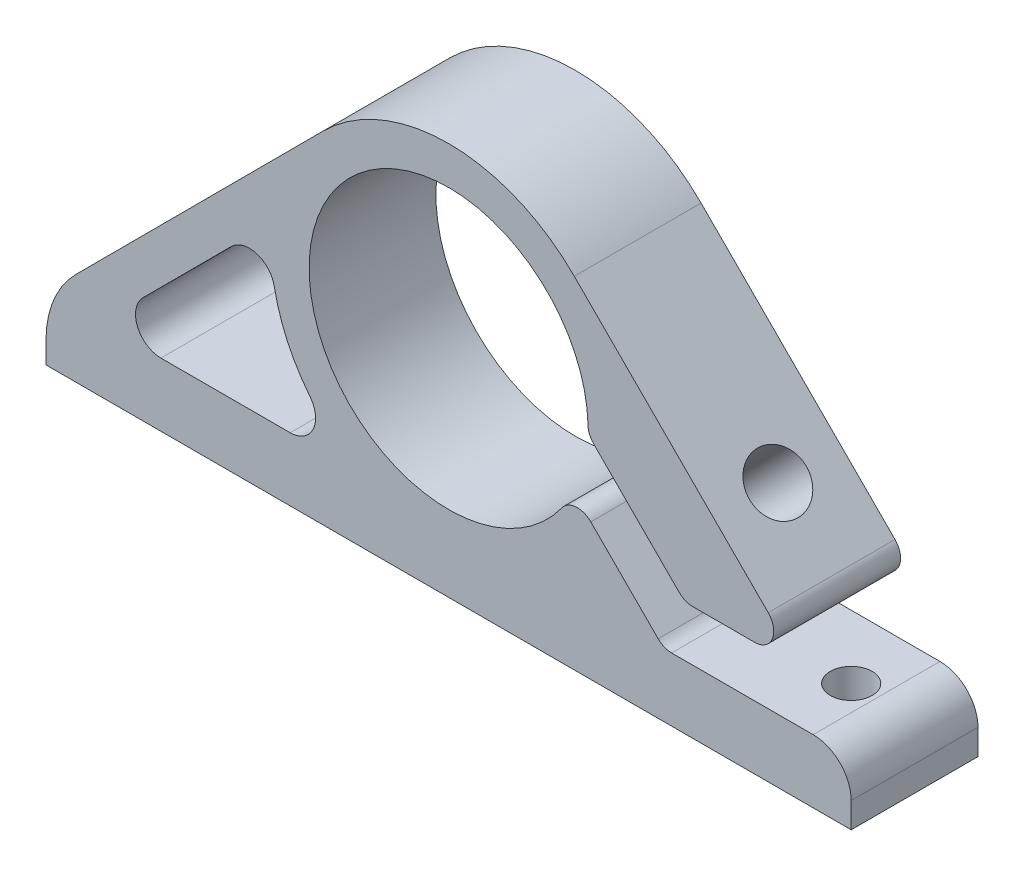
ISO-10303-21;
HEADER;
FILE_DESCRIPTION(('STEP AP214'),'2;1');
FILE_NAME('part.step','',(''),(''),'','','');
FILE_SCHEMA(('AUTOMOTIVE_DESIGN { 1 0 10303 214 1 1 1 1 }'));
ENDSEC;
DATA;
#1=APPLICATION_CONTEXT('core data for automotive mechanical design processes');
#2=APPLICATION_PROTOCOL_DEFINITION('international standard','automotive_design',2000,#1);
#3=PRODUCT_CONTEXT('',#1,'mechanical');
#4=PRODUCT('Part','Part','',(#3));
#5=PRODUCT_RELATED_PRODUCT_CATEGORY('part','',(#4));
#6=PRODUCT_DEFINITION_FORMATION('','',#4);
#7=PRODUCT_DEFINITION_CONTEXT('part definition',#1,'design');
#8=PRODUCT_DEFINITION('design','',#6,#7);
#9=PRODUCT_DEFINITION_SHAPE('','',#8);
#10=(LENGTH_UNIT() NAMED_UNIT(*) SI_UNIT(.MILLI.,.METRE.));
#11=(NAMED_UNIT(*) PLANE_ANGLE_UNIT() SI_UNIT($,.RADIAN.));
#12=(NAMED_UNIT(*) SI_UNIT($,.STERADIAN.) SOLID_ANGLE_UNIT());
#13=UNCERTAINTY_MEASURE_WITH_UNIT(LENGTH_MEASURE(1.E-05),#10,'distance_accuracy_value','');
#14=(GEOMETRIC_REPRESENTATION_CONTEXT(3) GLOBAL_UNCERTAINTY_ASSIGNED_CONTEXT((#13)) GLOBAL_UNIT_ASSIGNED_CONTEXT((#10,
#11,#12)) REPRESENTATION_CONTEXT('',''));
#15=CARTESIAN_POINT('',(0.,0.,0.));
#16=DIRECTION('',(0.,0.,1.));
#17=DIRECTION('',(1.,0.,0.));
#18=AXIS2_PLACEMENT_3D('',#15,#16,#17);
#19=CARTESIAN_POINT('',(0.,0.,10.));
#20=DIRECTION('',(0.,0.,1.));
#21=DIRECTION('',(1.,0.,0.));
#22=AXIS2_PLACEMENT_3D('',#19,#20,#21);
#23=PLANE('',#22);
#24=CARTESIAN_POINT('',(0.,0.,10.));
#25=DIRECTION('',(0.,0.,-1.));
#26=DIRECTION('',(1.,0.,0.));
#27=AXIS2_PLACEMENT_3D('',#24,#25,#26);
#28=CIRCLE('',#27,14.);
#29=CARTESIAN_POINT('',(-10.9287464971972,-8.75,10.));
#30=VERTEX_POINT('',#29);
#31=CARTESIAN_POINT('',(-13.7504022944796,-2.63181244391958,10.));
#32=VERTEX_POINT('',#31);
#33=EDGE_CURVE('E232',#30,#32,#28,.T.);
#34=ORIENTED_EDGE('',*,*,#33,.F.);
#35=CARTESIAN_POINT('',(-12.4899959967968,-10.,10.));
#36=DIRECTION('',(0.,0.,1.));
#37=DIRECTION('',(1.,0.,0.));
#38=AXIS2_PLACEMENT_3D('',#35,#36,#37);
#39=CIRCLE('',#38,2.);
#40=CARTESIAN_POINT('',(-12.4899959967968,-12.,10.));
#41=VERTEX_POINT('',#40);
#42=EDGE_CURVE('E395',#30,#41,#39,.F.);
#43=ORIENTED_EDGE('',*,*,#42,.T.);
#44=DIRECTION('',(1.,0.,0.));
#45=VECTOR('',#44,1.);
#46=CARTESIAN_POINT('',(-22.6913140604261,-12.,10.));
#47=LINE('',#46,#45);
#48=CARTESIAN_POINT('',(-22.6913140604261,-12.,10.));
#49=VERTEX_POINT('',#48);
#50=EDGE_CURVE('E238',#49,#41,#47,.T.);
#51=ORIENTED_EDGE('',*,*,#50,.F.);
#52=CARTESIAN_POINT('',(-22.6913140604261,-10.,10.));
#53=DIRECTION('',(0.,0.,1.));
#54=DIRECTION('',(1.,0.,0.));
#55=AXIS2_PLACEMENT_3D('',#52,#53,#54);
#56=CIRCLE('',#55,2.);
#57=CARTESIAN_POINT('',(-24.1071107280171,-8.58737131699868,10.));
#58=VERTEX_POINT('',#57);
#59=EDGE_CURVE('E209',#58,#49,#56,.T.);
#60=ORIENTED_EDGE('',*,*,#59,.F.);
#61=DIRECTION('',(-0.706314341500663,-0.707898333795528,0.));
#62=VECTOR('',#61,1.);
#63=CARTESIAN_POINT('',(-13.9037432997193,1.63887835287128,10.));
#64=LINE('',#63,#62);
#65=CARTESIAN_POINT('',(-17.1305421469963,-1.59515696719248,10.));
#66=VERTEX_POINT('',#65);
#67=EDGE_CURVE('E235',#66,#58,#64,.T.);
#68=ORIENTED_EDGE('',*,*,#67,.F.);
#69=CARTESIAN_POINT('',(-15.7147454794053,-3.00778565019381,10.));
#70=DIRECTION('',(0.,0.,1.));
#71=DIRECTION('',(1.,0.,0.));
#72=AXIS2_PLACEMENT_3D('',#69,#70,#71);
#73=CIRCLE('',#72,2.);
#74=EDGE_CURVE('E399',#66,#32,#73,.F.);
#75=ORIENTED_EDGE('',*,*,#74,.T.);
#76=EDGE_LOOP('',(#34,#43,#51,#60,#68,#75));
#77=FACE_BOUND('',#76,.T.);
#78=DIRECTION('',(-0.706314341500663,-0.707898333795528,0.));
#79=VECTOR('',#78,1.);
#80=CARTESIAN_POINT('',(-31.7499999999999,-12.,10.));
#81=LINE('',#80,#79);
#82=CARTESIAN_POINT('',(-9.9105766731374,9.88840078100929,10.));
#83=VERTEX_POINT('',#82);
#84=CARTESIAN_POINT('',(-29.4131866703642,-9.65794609390811,10.));
#85=VERTEX_POINT('',#84);
#86=EDGE_CURVE('E303',#83,#85,#81,.T.);
#87=ORIENTED_EDGE('',*,*,#86,.T.);
#88=CARTESIAN_POINT('',(-23.7499999999999,-15.3084608259134,10.));
#89=DIRECTION('',(0.,0.,1.));
#90=DIRECTION('',(1.,0.,0.));
#91=AXIS2_PLACEMENT_3D('',#88,#89,#90);
#92=CIRCLE('',#91,8.);
#93=CARTESIAN_POINT('',(-31.7499999999999,-15.3084608259134,10.));
#94=VERTEX_POINT('',#93);
#95=EDGE_CURVE('E11',#85,#94,#92,.T.);
#96=ORIENTED_EDGE('',*,*,#95,.T.);
#97=DIRECTION('',(0.,-1.,0.));
#98=VECTOR('',#97,1.);
#99=CARTESIAN_POINT('',(-31.7499999999999,-12.,10.));
#100=LINE('',#99,#98);
#101=CARTESIAN_POINT('',(-31.7499999999999,-17.,10.));
#102=VERTEX_POINT('',#101);
#103=EDGE_CURVE('E305',#94,#102,#100,.T.);
#104=ORIENTED_EDGE('',*,*,#103,.T.);
#105=DIRECTION('',(1.,0.,0.));
#106=VECTOR('',#105,1.);
#107=CARTESIAN_POINT('',(-31.7499999999999,-17.,10.));
#108=LINE('',#107,#106);
#109=CARTESIAN_POINT('',(31.7500000000001,-17.,10.));
#110=VERTEX_POINT('',#109);
#111=EDGE_CURVE('E307',#102,#110,#108,.T.);
#112=ORIENTED_EDGE('',*,*,#111,.T.);
#113=DIRECTION('',(0.,1.,0.));
#114=VECTOR('',#113,1.);
#115=CARTESIAN_POINT('',(31.7500000000001,-12.,10.));
#116=LINE('',#115,#114);
#117=CARTESIAN_POINT('',(31.7500000000001,-15.,10.));
#118=VERTEX_POINT('',#117);
#119=EDGE_CURVE('E295',#110,#118,#116,.T.);
#120=ORIENTED_EDGE('',*,*,#119,.T.);
#121=CARTESIAN_POINT('',(28.7500000000001,-15.,10.));
#122=DIRECTION('',(0.,0.,1.));
#123=DIRECTION('',(1.,0.,0.));
#124=AXIS2_PLACEMENT_3D('',#121,#122,#123);
#125=CIRCLE('',#124,3.);
#126=CARTESIAN_POINT('',(28.7500000000001,-12.,10.));
#127=VERTEX_POINT('',#126);
#128=EDGE_CURVE('E384',#118,#127,#125,.T.);
#129=ORIENTED_EDGE('',*,*,#128,.T.);
#130=DIRECTION('',(1.,0.,0.));
#131=VECTOR('',#130,1.);
#132=CARTESIAN_POINT('',(31.7500000000001,-12.,10.));
#133=LINE('',#132,#131);
#134=CARTESIAN_POINT('',(17.5868200661706,-12.,10.));
#135=VERTEX_POINT('',#134);
#136=EDGE_CURVE('E281',#135,#127,#133,.T.);
#137=ORIENTED_EDGE('',*,*,#136,.F.);
#138=CARTESIAN_POINT('',(17.5868200661706,-10.5,10.));
#139=DIRECTION('',(0.,0.,1.));
#140=DIRECTION('',(1.,0.,0.));
#141=AXIS2_PLACEMENT_3D('',#138,#139,#140);
#142=CIRCLE('',#141,1.5);
#143=CARTESIAN_POINT('',(16.5249725654773,-11.559471512251,10.));
#144=VERTEX_POINT('',#143);
#145=EDGE_CURVE('E373',#135,#144,#142,.F.);
#146=ORIENTED_EDGE('',*,*,#145,.T.);
#147=DIRECTION('',(0.706314341500665,-0.707898333795526,0.));
#148=VECTOR('',#147,1.);
#149=CARTESIAN_POINT('',(9.85899564609831,-4.87854536211508,10.));
#150=LINE('',#149,#148);
#151=CARTESIAN_POINT('',(11.2126058764745,-6.23519122131712,10.));
#152=VERTEX_POINT('',#151);
#153=EDGE_CURVE('E264',#152,#144,#150,.T.);
#154=ORIENTED_EDGE('',*,*,#153,.F.);
#155=CARTESIAN_POINT('',(10.1507583757812,-7.29466273356811,10.));
#156=DIRECTION('',(0.,0.,1.));
#157=DIRECTION('',(1.,0.,0.));
#158=AXIS2_PLACEMENT_3D('',#155,#156,#157);
#159=CIRCLE('',#158,1.5);
#160=CARTESIAN_POINT('',(8.93266737068747,-6.41930320553994,10.));
#161=VERTEX_POINT('',#160);
#162=EDGE_CURVE('E341',#152,#161,#159,.T.);
#163=ORIENTED_EDGE('',*,*,#162,.T.);
#164=CARTESIAN_POINT('',(0.,0.,10.));
#165=DIRECTION('',(0.,0.,1.));
#166=DIRECTION('',(1.,0.,0.));
#167=AXIS2_PLACEMENT_3D('',#164,#165,#166);
#168=CIRCLE('',#167,11.);
#169=CARTESIAN_POINT('',(10.9975421875151,0.232520609461726,10.));
#170=VERTEX_POINT('',#169);
#171=EDGE_CURVE('E289',#170,#161,#168,.T.);
#172=ORIENTED_EDGE('',*,*,#171,.F.);
#173=CARTESIAN_POINT('',(12.4972070312672,0.264227965297416,10.));
#174=DIRECTION('',(0.,0.,1.));
#175=DIRECTION('',(1.,0.,0.));
#176=AXIS2_PLACEMENT_3D('',#173,#174,#175);
#177=CIRCLE('',#176,1.5);
#178=CARTESIAN_POINT('',(11.4353595305739,-0.79524354695358,10.));
#179=VERTEX_POINT('',#178);
#180=EDGE_CURVE('E343',#170,#179,#177,.T.);
#181=ORIENTED_EDGE('',*,*,#180,.T.);
#182=DIRECTION('',(-0.706314341500665,0.707898333795526,0.));
#183=VECTOR('',#182,1.);
#184=CARTESIAN_POINT('',(10.9943273556234,-0.353222305908989,10.));
#185=LINE('',#184,#183);
#186=CARTESIAN_POINT('',(18.1844518690925,-7.559471512251,10.));
#187=VERTEX_POINT('',#186);
#188=EDGE_CURVE('E269',#187,#179,#185,.T.);
#189=ORIENTED_EDGE('',*,*,#188,.F.);
#190=CARTESIAN_POINT('',(19.2462993697858,-6.5,10.));
#191=DIRECTION('',(0.,0.,1.));
#192=DIRECTION('',(1.,0.,0.));
#193=AXIS2_PLACEMENT_3D('',#190,#191,#192);
#194=CIRCLE('',#193,1.5);
#195=CARTESIAN_POINT('',(19.2462993697858,-8.,10.));
#196=VERTEX_POINT('',#195);
#197=EDGE_CURVE('E337',#187,#196,#194,.T.);
#198=ORIENTED_EDGE('',*,*,#197,.T.);
#199=DIRECTION('',(-1.,0.,0.));
#200=VECTOR('',#199,1.);
#201=CARTESIAN_POINT('',(31.7500000000001,-8.,10.));
#202=LINE('',#201,#200);
#203=CARTESIAN_POINT('',(24.1433584510894,-8.,10.));
#204=VERTEX_POINT('',#203);
#205=EDGE_CURVE('E284',#204,#196,#202,.T.);
#206=ORIENTED_EDGE('',*,*,#205,.F.);
#207=CARTESIAN_POINT('',(24.1433584510894,-6.5,10.));
#208=DIRECTION('',(0.,0.,1.));
#209=DIRECTION('',(1.,0.,0.));
#210=AXIS2_PLACEMENT_3D('',#207,#208,#209);
#211=CIRCLE('',#210,1.5);
#212=CARTESIAN_POINT('',(25.2052059517827,-5.440528487749,10.));
#213=VERTEX_POINT('',#212);
#214=EDGE_CURVE('E339',#204,#213,#211,.T.);
#215=ORIENTED_EDGE('',*,*,#214,.T.);
#216=DIRECTION('',(-0.706314341500666,0.707898333795526,0.));
#217=VECTOR('',#216,1.);
#218=CARTESIAN_POINT('',(31.7500000000001,-12.,10.));
#219=LINE('',#218,#217);
#220=CARTESIAN_POINT('',(9.91057667313737,9.88840078100932,10.));
#221=VERTEX_POINT('',#220);
#222=EDGE_CURVE('E298',#213,#221,#219,.T.);
#223=ORIENTED_EDGE('',*,*,#222,.T.);
#224=CARTESIAN_POINT('',(0.,0.,10.));
#225=DIRECTION('',(0.,0.,1.));
#226=DIRECTION('',(1.,0.,0.));
#227=AXIS2_PLACEMENT_3D('',#224,#225,#226);
#228=CIRCLE('',#227,14.);
#229=EDGE_CURVE('E301',#221,#83,#228,.T.);
#230=ORIENTED_EDGE('',*,*,#229,.T.);
#231=EDGE_LOOP('',(#87,#96,#104,#112,#120,#129,#137,#146,#154,#163,#172,#181,#189,#198,#206,
#215,#223,#230));
#232=FACE_BOUND('',#231,.T.);
#233=ADVANCED_FACE('F37',(#77,#232),#23,.T.);
#234=CARTESIAN_POINT('',(0.,0.,0.));
#235=DIRECTION('',(0.,0.,1.));
#236=DIRECTION('',(1.,0.,0.));
#237=AXIS2_PLACEMENT_3D('',#234,#235,#236);
#238=PLANE('',#237);
#239=DIRECTION('',(1.,0.,0.));
#240=VECTOR('',#239,1.);
#241=CARTESIAN_POINT('',(-22.6913140604261,-12.,0.));
#242=LINE('',#241,#240);
#243=CARTESIAN_POINT('',(-22.6913140604261,-12.,0.));
#244=VERTEX_POINT('',#243);
#245=CARTESIAN_POINT('',(-12.4899959967968,-12.,0.));
#246=VERTEX_POINT('',#245);
#247=EDGE_CURVE('E217',#244,#246,#242,.T.);
#248=ORIENTED_EDGE('',*,*,#247,.T.);
#249=CARTESIAN_POINT('',(-12.4899959967968,-10.,0.));
#250=DIRECTION('',(0.,0.,1.));
#251=DIRECTION('',(1.,0.,0.));
#252=AXIS2_PLACEMENT_3D('',#249,#250,#251);
#253=CIRCLE('',#252,2.);
#254=CARTESIAN_POINT('',(-10.9287464971972,-8.75,0.));
#255=VERTEX_POINT('',#254);
#256=EDGE_CURVE('E397',#246,#255,#253,.T.);
#257=ORIENTED_EDGE('',*,*,#256,.T.);
#258=CARTESIAN_POINT('',(0.,0.,0.));
#259=DIRECTION('',(0.,0.,-1.));
#260=DIRECTION('',(1.,0.,0.));
#261=AXIS2_PLACEMENT_3D('',#258,#259,#260);
#262=CIRCLE('',#261,14.);
#263=CARTESIAN_POINT('',(-13.7504022944796,-2.63181244391958,0.));
#264=VERTEX_POINT('',#263);
#265=EDGE_CURVE('E228',#255,#264,#262,.T.);
#266=ORIENTED_EDGE('',*,*,#265,.T.);
#267=CARTESIAN_POINT('',(-15.7147454794053,-3.00778565019381,0.));
#268=DIRECTION('',(0.,0.,1.));
#269=DIRECTION('',(1.,0.,0.));
#270=AXIS2_PLACEMENT_3D('',#267,#268,#269);
#271=CIRCLE('',#270,2.);
#272=CARTESIAN_POINT('',(-17.1305421469963,-1.59515696719248,0.));
#273=VERTEX_POINT('',#272);
#274=EDGE_CURVE('E401',#264,#273,#271,.T.);
#275=ORIENTED_EDGE('',*,*,#274,.T.);
#276=DIRECTION('',(-0.706314341500663,-0.707898333795528,0.));
#277=VECTOR('',#276,1.);
#278=CARTESIAN_POINT('',(-13.9037432997193,1.63887835287128,0.));
#279=LINE('',#278,#277);
#280=CARTESIAN_POINT('',(-24.1071107280171,-8.58737131699867,0.));
#281=VERTEX_POINT('',#280);
#282=EDGE_CURVE('E226',#273,#281,#279,.T.);
#283=ORIENTED_EDGE('',*,*,#282,.T.);
#284=CARTESIAN_POINT('',(-22.6913140604261,-10.,0.));
#285=DIRECTION('',(0.,0.,1.));
#286=DIRECTION('',(1.,0.,0.));
#287=AXIS2_PLACEMENT_3D('',#284,#285,#286);
#288=CIRCLE('',#287,2.);
#289=EDGE_CURVE('E206',#281,#244,#288,.T.);
#290=ORIENTED_EDGE('',*,*,#289,.T.);
#291=EDGE_LOOP('',(#248,#257,#266,#275,#283,#290));
#292=FACE_BOUND('',#291,.T.);
#293=DIRECTION('',(0.,-1.,0.));
#294=VECTOR('',#293,1.);
#295=CARTESIAN_POINT('',(-31.7499999999999,-12.,0.));
#296=LINE('',#295,#294);
#297=CARTESIAN_POINT('',(-31.7499999999999,-15.3084608259134,0.));
#298=VERTEX_POINT('',#297);
#299=CARTESIAN_POINT('',(-31.7499999999999,-17.,0.));
#300=VERTEX_POINT('',#299);
#301=EDGE_CURVE('E318',#298,#300,#296,.T.);
#302=ORIENTED_EDGE('',*,*,#301,.F.);
#303=CARTESIAN_POINT('',(-23.7499999999999,-15.3084608259134,0.));
#304=DIRECTION('',(0.,0.,1.));
#305=DIRECTION('',(1.,0.,0.));
#306=AXIS2_PLACEMENT_3D('',#303,#304,#305);
#307=CIRCLE('',#306,8.);
#308=CARTESIAN_POINT('',(-29.4131866703642,-9.65794609390811,0.));
#309=VERTEX_POINT('',#308);
#310=EDGE_CURVE('E59',#298,#309,#307,.F.);
#311=ORIENTED_EDGE('',*,*,#310,.T.);
#312=DIRECTION('',(-0.706314341500663,-0.707898333795528,0.));
#313=VECTOR('',#312,1.);
#314=CARTESIAN_POINT('',(-31.7499999999999,-12.,0.));
#315=LINE('',#314,#313);
#316=CARTESIAN_POINT('',(-9.9105766731374,9.88840078100929,0.));
#317=VERTEX_POINT('',#316);
#318=EDGE_CURVE('E316',#317,#309,#315,.T.);
#319=ORIENTED_EDGE('',*,*,#318,.F.);
#320=CARTESIAN_POINT('',(0.,0.,0.));
#321=DIRECTION('',(0.,0.,1.));
#322=DIRECTION('',(1.,0.,0.));
#323=AXIS2_PLACEMENT_3D('',#320,#321,#322);
#324=CIRCLE('',#323,14.);
#325=CARTESIAN_POINT('',(9.91057667313737,9.88840078100932,0.));
#326=VERTEX_POINT('',#325);
#327=EDGE_CURVE('E314',#326,#317,#324,.T.);
#328=ORIENTED_EDGE('',*,*,#327,.F.);
#329=DIRECTION('',(-0.706314341500666,0.707898333795526,0.));
#330=VECTOR('',#329,1.);
#331=CARTESIAN_POINT('',(31.7500000000001,-12.,0.));
#332=LINE('',#331,#330);
#333=CARTESIAN_POINT('',(25.2052059517827,-5.440528487749,0.));
#334=VERTEX_POINT('',#333);
#335=EDGE_CURVE('E312',#334,#326,#332,.T.);
#336=ORIENTED_EDGE('',*,*,#335,.F.);
#337=CARTESIAN_POINT('',(24.1433584510894,-6.5,0.));
#338=DIRECTION('',(0.,0.,1.));
#339=DIRECTION('',(1.,0.,0.));
#340=AXIS2_PLACEMENT_3D('',#337,#338,#339);
#341=CIRCLE('',#340,1.5);
#342=CARTESIAN_POINT('',(24.1433584510894,-8.,0.));
#343=VERTEX_POINT('',#342);
#344=EDGE_CURVE('E352',#334,#343,#341,.F.);
#345=ORIENTED_EDGE('',*,*,#344,.T.);
#346=DIRECTION('',(-1.,0.,0.));
#347=VECTOR('',#346,1.);
#348=CARTESIAN_POINT('',(31.7500000000001,-8.,0.));
#349=LINE('',#348,#347);
#350=CARTESIAN_POINT('',(19.2462993697858,-8.,0.));
#351=VERTEX_POINT('',#350);
#352=EDGE_CURVE('E272',#343,#351,#349,.T.);
#353=ORIENTED_EDGE('',*,*,#352,.T.);
#354=CARTESIAN_POINT('',(19.2462993697858,-6.5,0.));
#355=DIRECTION('',(0.,0.,1.));
#356=DIRECTION('',(1.,0.,0.));
#357=AXIS2_PLACEMENT_3D('',#354,#355,#356);
#358=CIRCLE('',#357,1.5);
#359=CARTESIAN_POINT('',(18.1844518690925,-7.559471512251,0.));
#360=VERTEX_POINT('',#359);
#361=EDGE_CURVE('E350',#351,#360,#358,.F.);
#362=ORIENTED_EDGE('',*,*,#361,.T.);
#363=DIRECTION('',(-0.706314341500665,0.707898333795526,0.));
#364=VECTOR('',#363,1.);
#365=CARTESIAN_POINT('',(10.9943273556234,-0.353222305908989,0.));
#366=LINE('',#365,#364);
#367=CARTESIAN_POINT('',(11.4353595305739,-0.79524354695358,0.));
#368=VERTEX_POINT('',#367);
#369=EDGE_CURVE('E275',#360,#368,#366,.T.);
#370=ORIENTED_EDGE('',*,*,#369,.T.);
#371=CARTESIAN_POINT('',(12.4972070312672,0.264227965297416,0.));
#372=DIRECTION('',(0.,0.,1.));
#373=DIRECTION('',(1.,0.,0.));
#374=AXIS2_PLACEMENT_3D('',#371,#372,#373);
#375=CIRCLE('',#374,1.5);
#376=CARTESIAN_POINT('',(10.9975421875151,0.232520609461726,0.));
#377=VERTEX_POINT('',#376);
#378=EDGE_CURVE('E356',#368,#377,#375,.F.);
#379=ORIENTED_EDGE('',*,*,#378,.T.);
#380=CARTESIAN_POINT('',(0.,0.,0.));
#381=DIRECTION('',(0.,0.,1.));
#382=DIRECTION('',(1.,0.,0.));
#383=AXIS2_PLACEMENT_3D('',#380,#381,#382);
#384=CIRCLE('',#383,11.);
#385=CARTESIAN_POINT('',(8.93266737068747,-6.41930320553994,0.));
#386=VERTEX_POINT('',#385);
#387=EDGE_CURVE('E278',#377,#386,#384,.T.);
#388=ORIENTED_EDGE('',*,*,#387,.T.);
#389=CARTESIAN_POINT('',(10.1507583757812,-7.29466273356811,0.));
#390=DIRECTION('',(0.,0.,1.));
#391=DIRECTION('',(1.,0.,0.));
#392=AXIS2_PLACEMENT_3D('',#389,#390,#391);
#393=CIRCLE('',#392,1.5);
#394=CARTESIAN_POINT('',(11.2126058764745,-6.23519122131712,0.));
#395=VERTEX_POINT('',#394);
#396=EDGE_CURVE('E354',#386,#395,#393,.F.);
#397=ORIENTED_EDGE('',*,*,#396,.T.);
#398=DIRECTION('',(0.706314341500665,-0.707898333795526,0.));
#399=VECTOR('',#398,1.);
#400=CARTESIAN_POINT('',(9.85899564609831,-4.87854536211508,0.));
#401=LINE('',#400,#399);
#402=CARTESIAN_POINT('',(16.5249725654773,-11.559471512251,0.));
#403=VERTEX_POINT('',#402);
#404=EDGE_CURVE('E265',#395,#403,#401,.T.);
#405=ORIENTED_EDGE('',*,*,#404,.T.);
#406=CARTESIAN_POINT('',(17.5868200661706,-10.5,0.));
#407=DIRECTION('',(0.,0.,1.));
#408=DIRECTION('',(1.,0.,0.));
#409=AXIS2_PLACEMENT_3D('',#406,#407,#408);
#410=CIRCLE('',#409,1.5);
#411=CARTESIAN_POINT('',(17.5868200661706,-12.,0.));
#412=VERTEX_POINT('',#411);
#413=EDGE_CURVE('E375',#403,#412,#410,.T.);
#414=ORIENTED_EDGE('',*,*,#413,.T.);
#415=DIRECTION('',(1.,0.,0.));
#416=VECTOR('',#415,1.);
#417=CARTESIAN_POINT('',(31.7500000000001,-12.,0.));
#418=LINE('',#417,#416);
#419=CARTESIAN_POINT('',(28.7500000000001,-12.,0.));
#420=VERTEX_POINT('',#419);
#421=EDGE_CURVE('E268',#412,#420,#418,.T.);
#422=ORIENTED_EDGE('',*,*,#421,.T.);
#423=CARTESIAN_POINT('',(28.7500000000001,-15.,0.));
#424=DIRECTION('',(0.,0.,1.));
#425=DIRECTION('',(1.,0.,0.));
#426=AXIS2_PLACEMENT_3D('',#423,#424,#425);
#427=CIRCLE('',#426,3.);
#428=CARTESIAN_POINT('',(31.7500000000001,-15.,0.));
#429=VERTEX_POINT('',#428);
#430=EDGE_CURVE('E380',#420,#429,#427,.F.);
#431=ORIENTED_EDGE('',*,*,#430,.T.);
#432=DIRECTION('',(0.,1.,0.));
#433=VECTOR('',#432,1.);
#434=CARTESIAN_POINT('',(31.7500000000001,-12.,0.));
#435=LINE('',#434,#433);
#436=CARTESIAN_POINT('',(31.7500000000001,-17.,0.));
#437=VERTEX_POINT('',#436);
#438=EDGE_CURVE('E292',#437,#429,#435,.T.);
#439=ORIENTED_EDGE('',*,*,#438,.F.);
#440=DIRECTION('',(1.,0.,0.));
#441=VECTOR('',#440,1.);
#442=CARTESIAN_POINT('',(-31.7499999999999,-17.,0.));
#443=LINE('',#442,#441);
#444=EDGE_CURVE('E299',#300,#437,#443,.T.);
#445=ORIENTED_EDGE('',*,*,#444,.F.);
#446=EDGE_LOOP('',(#302,#311,#319,#328,#336,#345,#353,#362,#370,#379,#388,#397,#405,#414,#422,
#431,#439,#445));
#447=FACE_BOUND('',#446,.T.);
#448=ADVANCED_FACE('F224',(#292,#447),#238,.F.);
#449=CARTESIAN_POINT('',(31.7500000000001,-12.,10.));
#450=DIRECTION('',(-1.,0.,0.));
#451=DIRECTION('',(0.,0.,1.));
#452=AXIS2_PLACEMENT_3D('',#449,#450,#451);
#453=PLANE('',#452);
#454=ORIENTED_EDGE('',*,*,#438,.T.);
#455=DIRECTION('',(0.,0.,-1.));
#456=VECTOR('',#455,1.);
#457=CARTESIAN_POINT('',(31.7500000000001,-15.,10.));
#458=LINE('',#457,#456);
#459=EDGE_CURVE('E382',#429,#118,#458,.F.);
#460=ORIENTED_EDGE('',*,*,#459,.T.);
#461=ORIENTED_EDGE('',*,*,#119,.F.);
#462=DIRECTION('',(0.,0.,-1.));
#463=VECTOR('',#462,1.);
#464=CARTESIAN_POINT('',(31.7500000000001,-17.,10.));
#465=LINE('',#464,#463);
#466=EDGE_CURVE('E309',#110,#437,#465,.T.);
#467=ORIENTED_EDGE('',*,*,#466,.T.);
#468=EDGE_LOOP('',(#454,#460,#461,#467));
#469=FACE_BOUND('',#468,.T.);
#470=ADVANCED_FACE('F421',(#469),#453,.F.);
#471=CARTESIAN_POINT('',(31.7500000000001,-12.,10.));
#472=DIRECTION('',(-0.707898333795526,-0.706314341500666,0.));
#473=DIRECTION('',(0.706314341500666,-0.707898333795526,0.));
#474=AXIS2_PLACEMENT_3D('',#471,#472,#473);
#475=PLANE('',#474);
#476=CARTESIAN_POINT('',(20.9673199027787,-1.19313848497585,5.));
#477=DIRECTION('',(0.707898333795525,0.706314341500666,0.));
#478=DIRECTION('',(-0.706314341500666,0.707898333795525,0.));
#479=AXIS2_PLACEMENT_3D('',#476,#477,#478);
#480=CIRCLE('',#479,2.24999999999999);
#481=CARTESIAN_POINT('',(19.3781126344022,0.399632766064077,5.));
#482=VERTEX_POINT('',#481);
#483=EDGE_CURVE('E246',#482,#482,#480,.T.);
#484=ORIENTED_EDGE('',*,*,#483,.F.);
#485=EDGE_LOOP('',(#484));
#486=FACE_BOUND('',#485,.T.);
#487=ORIENTED_EDGE('',*,*,#222,.F.);
#488=DIRECTION('',(0.,0.,-1.));
#489=VECTOR('',#488,1.);
#490=CARTESIAN_POINT('',(25.2052059517827,-5.440528487749,10.));
#491=LINE('',#490,#489);
#492=EDGE_CURVE('E363',#213,#334,#491,.T.);
#493=ORIENTED_EDGE('',*,*,#492,.T.);
#494=ORIENTED_EDGE('',*,*,#335,.T.);
#495=DIRECTION('',(0.,0.,-1.));
#496=VECTOR('',#495,1.);
#497=CARTESIAN_POINT('',(9.91057667313737,9.88840078100932,10.));
#498=LINE('',#497,#496);
#499=EDGE_CURVE('E329',#221,#326,#498,.T.);
#500=ORIENTED_EDGE('',*,*,#499,.F.);
#501=EDGE_LOOP('',(#487,#493,#494,#500));
#502=FACE_BOUND('',#501,.T.);
#503=ADVANCED_FACE('F476',(#486,#502),#475,.F.);
#504=CARTESIAN_POINT('',(0.,0.,10.));
#505=DIRECTION('',(0.,0.,-1.));
#506=DIRECTION('',(-1.,0.,0.));
#507=AXIS2_PLACEMENT_3D('',#504,#505,#506);
#508=CYLINDRICAL_SURFACE('',#507,14.);
#509=ORIENTED_EDGE('',*,*,#327,.T.);
#510=DIRECTION('',(0.,0.,-1.));
#511=VECTOR('',#510,1.);
#512=CARTESIAN_POINT('',(-9.9105766731374,9.88840078100929,10.));
#513=LINE('',#512,#511);
#514=EDGE_CURVE('E326',#83,#317,#513,.T.);
#515=ORIENTED_EDGE('',*,*,#514,.F.);
#516=ORIENTED_EDGE('',*,*,#229,.F.);
#517=ORIENTED_EDGE('',*,*,#499,.T.);
#518=EDGE_LOOP('',(#509,#515,#516,#517));
#519=FACE_BOUND('',#518,.T.);
#520=ADVANCED_FACE('F482',(#519),#508,.T.);
#521=CARTESIAN_POINT('',(-31.7499999999999,-12.,10.));
#522=DIRECTION('',(0.707898333795528,-0.706314341500663,0.));
#523=DIRECTION('',(0.706314341500663,0.707898333795528,0.));
#524=AXIS2_PLACEMENT_3D('',#521,#522,#523);
#525=PLANE('',#524);
#526=ORIENTED_EDGE('',*,*,#318,.T.);
#527=DIRECTION('',(0.,0.,-1.));
#528=VECTOR('',#527,1.);
#529=CARTESIAN_POINT('',(-29.4131866703642,-9.65794609390811,10.));
#530=LINE('',#529,#528);
#531=EDGE_CURVE('E45',#309,#85,#530,.F.);
#532=ORIENTED_EDGE('',*,*,#531,.T.);
#533=ORIENTED_EDGE('',*,*,#86,.F.);
#534=ORIENTED_EDGE('',*,*,#514,.T.);
#535=EDGE_LOOP('',(#526,#532,#533,#534));
#536=FACE_BOUND('',#535,.T.);
#537=ADVANCED_FACE('F507',(#536),#525,.F.);
#538=CARTESIAN_POINT('',(-31.7499999999999,-12.,10.));
#539=DIRECTION('',(1.,0.,0.));
#540=DIRECTION('',(0.,0.,-1.));
#541=AXIS2_PLACEMENT_3D('',#538,#539,#540);
#542=PLANE('',#541);
#543=ORIENTED_EDGE('',*,*,#103,.F.);
#544=DIRECTION('',(0.,0.,-1.));
#545=VECTOR('',#544,1.);
#546=CARTESIAN_POINT('',(-31.7499999999999,-15.3084608259134,10.));
#547=LINE('',#546,#545);
#548=EDGE_CURVE('E403',#94,#298,#547,.T.);
#549=ORIENTED_EDGE('',*,*,#548,.T.);
#550=ORIENTED_EDGE('',*,*,#301,.T.);
#551=DIRECTION('',(0.,0.,-1.));
#552=VECTOR('',#551,1.);
#553=CARTESIAN_POINT('',(-31.7499999999999,-17.,10.));
#554=LINE('',#553,#552);
#555=EDGE_CURVE('E323',#102,#300,#554,.T.);
#556=ORIENTED_EDGE('',*,*,#555,.F.);
#557=EDGE_LOOP('',(#543,#549,#550,#556));
#558=FACE_BOUND('',#557,.T.);
#559=ADVANCED_FACE('F409',(#558),#542,.F.);
#560=CARTESIAN_POINT('',(-31.7499999999999,-17.,10.));
#561=DIRECTION('',(0.,1.,0.));
#562=DIRECTION('',(0.,0.,1.));
#563=AXIS2_PLACEMENT_3D('',#560,#561,#562);
#564=PLANE('',#563);
#565=CARTESIAN_POINT('',(5.12500965710509,-17.,5.));
#566=DIRECTION('',(0.,1.,0.));
#567=DIRECTION('',(1.,0.,0.));
#568=AXIS2_PLACEMENT_3D('',#565,#566,#567);
#569=ELLIPSE('',#568,2.33607036279956,1.64999999999999);
#570=CARTESIAN_POINT('',(7.46108001990465,-17.,5.));
#571=VERTEX_POINT('',#570);
#572=EDGE_CURVE('E243',#571,#571,#569,.T.);
#573=ORIENTED_EDGE('',*,*,#572,.T.);
#574=EDGE_LOOP('',(#573));
#575=FACE_BOUND('',#574,.T.);
#576=CARTESIAN_POINT('',(-26.7499999999999,-17.,5.));
#577=DIRECTION('',(0.,-1.,0.));
#578=DIRECTION('',(0.,0.,-1.));
#579=AXIS2_PLACEMENT_3D('',#576,#577,#578);
#580=CIRCLE('',#579,1.64999999999999);
#581=CARTESIAN_POINT('',(-26.7499999999999,-17.,3.35000000000001));
#582=VERTEX_POINT('',#581);
#583=EDGE_CURVE('E252',#582,#582,#580,.T.);
#584=ORIENTED_EDGE('',*,*,#583,.F.);
#585=EDGE_LOOP('',(#584));
#586=FACE_BOUND('',#585,.T.);
#587=CARTESIAN_POINT('',(26.7500000000001,-17.,5.));
#588=DIRECTION('',(0.,-1.,0.));
#589=DIRECTION('',(0.,0.,-1.));
#590=AXIS2_PLACEMENT_3D('',#587,#588,#589);
#591=CIRCLE('',#590,1.64999999999999);
#592=CARTESIAN_POINT('',(26.7500000000001,-17.,3.35000000000001));
#593=VERTEX_POINT('',#592);
#594=EDGE_CURVE('E258',#593,#593,#591,.T.);
#595=ORIENTED_EDGE('',*,*,#594,.F.);
#596=EDGE_LOOP('',(#595));
#597=FACE_BOUND('',#596,.T.);
#598=ORIENTED_EDGE('',*,*,#444,.T.);
#599=ORIENTED_EDGE('',*,*,#466,.F.);
#600=ORIENTED_EDGE('',*,*,#111,.F.);
#601=ORIENTED_EDGE('',*,*,#555,.T.);
#602=EDGE_LOOP('',(#598,#599,#600,#601));
#603=FACE_BOUND('',#602,.T.);
#604=ADVANCED_FACE('F417',(#575,#586,#597,#603),#564,.F.);
#605=CARTESIAN_POINT('',(0.,0.,10.));
#606=DIRECTION('',(0.,0.,-1.));
#607=DIRECTION('',(-1.,0.,0.));
#608=AXIS2_PLACEMENT_3D('',#605,#606,#607);
#609=CYLINDRICAL_SURFACE('',#608,11.);
#610=ORIENTED_EDGE('',*,*,#387,.F.);
#611=DIRECTION('',(0.,0.,-1.));
#612=VECTOR('',#611,1.);
#613=CARTESIAN_POINT('',(10.9975421875152,0.232520609461726,10.));
#614=LINE('',#613,#612);
#615=EDGE_CURVE('E334',#377,#170,#614,.F.);
#616=ORIENTED_EDGE('',*,*,#615,.T.);
#617=ORIENTED_EDGE('',*,*,#171,.T.);
#618=DIRECTION('',(0.,0.,-1.));
#619=VECTOR('',#618,1.);
#620=CARTESIAN_POINT('',(8.93266737068747,-6.41930320553994,10.));
#621=LINE('',#620,#619);
#622=EDGE_CURVE('E332',#161,#386,#621,.T.);
#623=ORIENTED_EDGE('',*,*,#622,.T.);
#624=EDGE_LOOP('',(#610,#616,#617,#623));
#625=FACE_BOUND('',#624,.T.);
#626=ADVANCED_FACE('F449',(#625),#609,.F.);
#627=CARTESIAN_POINT('',(9.85899564609831,-4.87854536211508,0.));
#628=DIRECTION('',(-0.707898333795526,-0.706314341500665,0.));
#629=DIRECTION('',(0.706314341500665,-0.707898333795526,0.));
#630=AXIS2_PLACEMENT_3D('',#627,#628,#629);
#631=PLANE('',#630);
#632=CARTESIAN_POINT('',(13.5580170696838,-8.58586227269437,5.));
#633=DIRECTION('',(0.707898333795526,0.706314341500665,0.));
#634=DIRECTION('',(-0.706314341500665,0.707898333795526,0.));
#635=AXIS2_PLACEMENT_3D('',#632,#633,#634);
#636=CIRCLE('',#635,1.64999999999999);
#637=CARTESIAN_POINT('',(12.3925984062077,-7.41783002193176,5.));
#638=VERTEX_POINT('',#637);
#639=EDGE_CURVE('E213',#638,#638,#636,.T.);
#640=ORIENTED_EDGE('',*,*,#639,.F.);
#641=EDGE_LOOP('',(#640));
#642=FACE_BOUND('',#641,.T.);
#643=ORIENTED_EDGE('',*,*,#404,.F.);
#644=DIRECTION('',(0.,0.,1.));
#645=VECTOR('',#644,1.);
#646=CARTESIAN_POINT('',(11.2126058764745,-6.23519122131712,10.));
#647=LINE('',#646,#645);
#648=EDGE_CURVE('E360',#395,#152,#647,.T.);
#649=ORIENTED_EDGE('',*,*,#648,.T.);
#650=ORIENTED_EDGE('',*,*,#153,.T.);
#651=DIRECTION('',(0.,0.,1.));
#652=VECTOR('',#651,1.);
#653=CARTESIAN_POINT('',(16.5249725654773,-11.559471512251,0.));
#654=LINE('',#653,#652);
#655=EDGE_CURVE('E358',#144,#403,#654,.F.);
#656=ORIENTED_EDGE('',*,*,#655,.T.);
#657=EDGE_LOOP('',(#643,#649,#650,#656));
#658=FACE_BOUND('',#657,.T.);
#659=ADVANCED_FACE('F440',(#642,#658),#631,.F.);
#660=CARTESIAN_POINT('',(31.7500000000001,-12.,0.));
#661=DIRECTION('',(0.,-1.,0.));
#662=DIRECTION('',(0.,0.,-1.));
#663=AXIS2_PLACEMENT_3D('',#660,#661,#662);
#664=PLANE('',#663);
#665=CARTESIAN_POINT('',(26.7500000000001,-12.,5.));
#666=DIRECTION('',(0.,-1.,0.));
#667=DIRECTION('',(0.,0.,-1.));
#668=AXIS2_PLACEMENT_3D('',#665,#666,#667);
#669=CIRCLE('',#668,1.65);
#670=CARTESIAN_POINT('',(26.7500000000001,-12.,3.35));
#671=VERTEX_POINT('',#670);
#672=EDGE_CURVE('E261',#671,#671,#669,.T.);
#673=ORIENTED_EDGE('',*,*,#672,.T.);
#674=EDGE_LOOP('',(#673));
#675=FACE_BOUND('',#674,.T.);
#676=ORIENTED_EDGE('',*,*,#136,.T.);
#677=DIRECTION('',(0.,0.,-1.));
#678=VECTOR('',#677,1.);
#679=CARTESIAN_POINT('',(28.7500000000001,-12.,0.));
#680=LINE('',#679,#678);
#681=EDGE_CURVE('E377',#127,#420,#680,.T.);
#682=ORIENTED_EDGE('',*,*,#681,.T.);
#683=ORIENTED_EDGE('',*,*,#421,.F.);
#684=DIRECTION('',(0.,0.,1.));
#685=VECTOR('',#684,1.);
#686=CARTESIAN_POINT('',(17.5868200661706,-12.,10.));
#687=LINE('',#686,#685);
#688=EDGE_CURVE('E370',#412,#135,#687,.T.);
#689=ORIENTED_EDGE('',*,*,#688,.T.);
#690=EDGE_LOOP('',(#676,#682,#683,#689));
#691=FACE_BOUND('',#690,.T.);
#692=ADVANCED_FACE('F431',(#675,#691),#664,.F.);
#693=CARTESIAN_POINT('',(31.7500000000001,-8.,0.));
#694=DIRECTION('',(0.,1.,0.));
#695=DIRECTION('',(0.,0.,1.));
#696=AXIS2_PLACEMENT_3D('',#693,#694,#695);
#697=PLANE('',#696);
#698=ORIENTED_EDGE('',*,*,#352,.F.);
#699=DIRECTION('',(0.,0.,-1.));
#700=VECTOR('',#699,1.);
#701=CARTESIAN_POINT('',(24.1433584510894,-8.,0.));
#702=LINE('',#701,#700);
#703=EDGE_CURVE('E368',#343,#204,#702,.F.);
#704=ORIENTED_EDGE('',*,*,#703,.T.);
#705=ORIENTED_EDGE('',*,*,#205,.T.);
#706=DIRECTION('',(0.,0.,1.));
#707=VECTOR('',#706,1.);
#708=CARTESIAN_POINT('',(19.2462993697858,-8.,0.));
#709=LINE('',#708,#707);
#710=EDGE_CURVE('E366',#196,#351,#709,.F.);
#711=ORIENTED_EDGE('',*,*,#710,.T.);
#712=EDGE_LOOP('',(#698,#704,#705,#711));
#713=FACE_BOUND('',#712,.T.);
#714=ADVANCED_FACE('F468',(#713),#697,.F.);
#715=CARTESIAN_POINT('',(10.9943273556234,-0.353222305908989,0.));
#716=DIRECTION('',(0.707898333795526,0.706314341500665,0.));
#717=DIRECTION('',(-0.706314341500665,0.707898333795526,0.));
#718=AXIS2_PLACEMENT_3D('',#715,#716,#717);
#719=PLANE('',#718);
#720=CARTESIAN_POINT('',(16.3896104048659,-5.76060490669171,5.));
#721=DIRECTION('',(0.707898333795526,0.706314341500665,0.));
#722=DIRECTION('',(-0.706314341500665,0.707898333795526,0.));
#723=AXIS2_PLACEMENT_3D('',#720,#721,#722);
#724=CIRCLE('',#723,2.24999999999999);
#725=CARTESIAN_POINT('',(14.8004031364894,-4.16783365565178,5.));
#726=VERTEX_POINT('',#725);
#727=EDGE_CURVE('E249',#726,#726,#724,.T.);
#728=ORIENTED_EDGE('',*,*,#727,.T.);
#729=EDGE_LOOP('',(#728));
#730=FACE_BOUND('',#729,.T.);
#731=ORIENTED_EDGE('',*,*,#188,.T.);
#732=DIRECTION('',(0.,0.,1.));
#733=VECTOR('',#732,1.);
#734=CARTESIAN_POINT('',(11.4353595305739,-0.795243546953581,0.));
#735=LINE('',#734,#733);
#736=EDGE_CURVE('E348',#179,#368,#735,.F.);
#737=ORIENTED_EDGE('',*,*,#736,.T.);
#738=ORIENTED_EDGE('',*,*,#369,.F.);
#739=DIRECTION('',(0.,0.,1.));
#740=VECTOR('',#739,1.);
#741=CARTESIAN_POINT('',(18.1844518690925,-7.559471512251,0.));
#742=LINE('',#741,#740);
#743=EDGE_CURVE('E345',#360,#187,#742,.T.);
#744=ORIENTED_EDGE('',*,*,#743,.T.);
#745=EDGE_LOOP('',(#731,#737,#738,#744));
#746=FACE_BOUND('',#745,.T.);
#747=ADVANCED_FACE('F457',(#730,#746),#719,.F.);
#748=CARTESIAN_POINT('',(12.4972070312672,0.264227965297416,10.));
#749=DIRECTION('',(0.,0.,-1.));
#750=DIRECTION('',(-1.,0.,0.));
#751=AXIS2_PLACEMENT_3D('',#748,#749,#750);
#752=CYLINDRICAL_SURFACE('',#751,1.5);
#753=ORIENTED_EDGE('',*,*,#378,.F.);
#754=ORIENTED_EDGE('',*,*,#736,.F.);
#755=ORIENTED_EDGE('',*,*,#180,.F.);
#756=ORIENTED_EDGE('',*,*,#615,.F.);
#757=EDGE_LOOP('',(#753,#754,#755,#756));
#758=FACE_BOUND('',#757,.T.);
#759=ADVANCED_FACE('F453',(#758),#752,.T.);
#760=CARTESIAN_POINT('',(10.1507583757812,-7.29466273356811,10.));
#761=DIRECTION('',(0.,0.,-1.));
#762=DIRECTION('',(-1.,0.,0.));
#763=AXIS2_PLACEMENT_3D('',#760,#761,#762);
#764=CYLINDRICAL_SURFACE('',#763,1.5);
#765=ORIENTED_EDGE('',*,*,#396,.F.);
#766=ORIENTED_EDGE('',*,*,#622,.F.);
#767=ORIENTED_EDGE('',*,*,#162,.F.);
#768=ORIENTED_EDGE('',*,*,#648,.F.);
#769=EDGE_LOOP('',(#765,#766,#767,#768));
#770=FACE_BOUND('',#769,.T.);
#771=ADVANCED_FACE('F444',(#770),#764,.T.);
#772=CARTESIAN_POINT('',(24.1433584510894,-6.5,10.));
#773=DIRECTION('',(0.,0.,-1.));
#774=DIRECTION('',(-1.,0.,0.));
#775=AXIS2_PLACEMENT_3D('',#772,#773,#774);
#776=CYLINDRICAL_SURFACE('',#775,1.5);
#777=ORIENTED_EDGE('',*,*,#214,.F.);
#778=ORIENTED_EDGE('',*,*,#703,.F.);
#779=ORIENTED_EDGE('',*,*,#344,.F.);
#780=ORIENTED_EDGE('',*,*,#492,.F.);
#781=EDGE_LOOP('',(#777,#778,#779,#780));
#782=FACE_BOUND('',#781,.T.);
#783=ADVANCED_FACE('F471',(#782),#776,.T.);
#784=CARTESIAN_POINT('',(17.5868200661706,-10.5,0.));
#785=DIRECTION('',(0.,0.,-1.));
#786=DIRECTION('',(-1.,0.,0.));
#787=AXIS2_PLACEMENT_3D('',#784,#785,#786);
#788=CYLINDRICAL_SURFACE('',#787,1.5);
#789=ORIENTED_EDGE('',*,*,#413,.F.);
#790=ORIENTED_EDGE('',*,*,#655,.F.);
#791=ORIENTED_EDGE('',*,*,#145,.F.);
#792=ORIENTED_EDGE('',*,*,#688,.F.);
#793=EDGE_LOOP('',(#789,#790,#791,#792));
#794=FACE_BOUND('',#793,.T.);
#795=ADVANCED_FACE('F437',(#794),#788,.F.);
#796=CARTESIAN_POINT('',(19.2462993697858,-6.5,0.));
#797=DIRECTION('',(0.,0.,1.));
#798=DIRECTION('',(1.,0.,0.));
#799=AXIS2_PLACEMENT_3D('',#796,#797,#798);
#800=CYLINDRICAL_SURFACE('',#799,1.5);
#801=ORIENTED_EDGE('',*,*,#361,.F.);
#802=ORIENTED_EDGE('',*,*,#710,.F.);
#803=ORIENTED_EDGE('',*,*,#197,.F.);
#804=ORIENTED_EDGE('',*,*,#743,.F.);
#805=EDGE_LOOP('',(#801,#802,#803,#804));
#806=FACE_BOUND('',#805,.T.);
#807=ADVANCED_FACE('F462',(#806),#800,.T.);
#808=CARTESIAN_POINT('',(26.7500000000001,-17.,5.));
#809=DIRECTION('',(0.,-1.,0.));
#810=DIRECTION('',(0.,0.,-1.));
#811=AXIS2_PLACEMENT_3D('',#808,#809,#810);
#812=CYLINDRICAL_SURFACE('',#811,1.65);
#813=ORIENTED_EDGE('',*,*,#672,.F.);
#814=EDGE_LOOP('',(#813));
#815=FACE_BOUND('',#814,.T.);
#816=ORIENTED_EDGE('',*,*,#594,.T.);
#817=EDGE_LOOP('',(#816));
#818=FACE_BOUND('',#817,.T.);
#819=ADVANCED_FACE('F527',(#815,#818),#812,.F.);
#820=CARTESIAN_POINT('',(-26.7499999999999,-12.,5.));
#821=DIRECTION('',(0.,-1.,0.));
#822=DIRECTION('',(0.,0.,-1.));
#823=AXIS2_PLACEMENT_3D('',#820,#821,#822);
#824=CONICAL_SURFACE('',#823,1.65,1.02974425867666);
#825=CARTESIAN_POINT('',(-26.7499999999999,-11.0085799786045,5.));
#826=VERTEX_POINT('',#825);
#827=VERTEX_LOOP('',#826);
#828=FACE_BOUND('',#827,.T.);
#829=CARTESIAN_POINT('',(-26.7499999999999,-12.,5.));
#830=DIRECTION('',(0.,-1.,0.));
#831=DIRECTION('',(0.,0.,-1.));
#832=AXIS2_PLACEMENT_3D('',#829,#830,#831);
#833=CIRCLE('',#832,1.65);
#834=CARTESIAN_POINT('',(-26.7499999999999,-12.,3.35));
#835=VERTEX_POINT('',#834);
#836=EDGE_CURVE('E255',#835,#835,#833,.T.);
#837=ORIENTED_EDGE('',*,*,#836,.T.);
#838=EDGE_LOOP('',(#837));
#839=FACE_BOUND('',#838,.T.);
#840=ADVANCED_FACE('F566',(#828,#839),#824,.F.);
#841=CARTESIAN_POINT('',(-26.7499999999999,-17.,5.));
#842=DIRECTION('',(0.,-1.,0.));
#843=DIRECTION('',(0.,0.,-1.));
#844=AXIS2_PLACEMENT_3D('',#841,#842,#843);
#845=CYLINDRICAL_SURFACE('',#844,1.64999999999999);
#846=ORIENTED_EDGE('',*,*,#836,.F.);
#847=EDGE_LOOP('',(#846));
#848=FACE_BOUND('',#847,.T.);
#849=ORIENTED_EDGE('',*,*,#583,.T.);
#850=EDGE_LOOP('',(#849));
#851=FACE_BOUND('',#850,.T.);
#852=ADVANCED_FACE('F562',(#848,#851),#845,.F.);
#853=CARTESIAN_POINT('',(20.9673199027787,-1.19313848497585,5.));
#854=DIRECTION('',(0.707898333795525,0.706314341500666,0.));
#855=DIRECTION('',(-0.706314341500666,0.707898333795525,0.));
#856=AXIS2_PLACEMENT_3D('',#853,#854,#855);
#857=CYLINDRICAL_SURFACE('',#856,2.24999999999999);
#858=ORIENTED_EDGE('',*,*,#727,.F.);
#859=EDGE_LOOP('',(#858));
#860=FACE_BOUND('',#859,.T.);
#861=ORIENTED_EDGE('',*,*,#483,.T.);
#862=EDGE_LOOP('',(#861));
#863=FACE_BOUND('',#862,.T.);
#864=ADVANCED_FACE('F558',(#860,#863),#857,.F.);
#865=CARTESIAN_POINT('',(13.5580170696838,-8.58586227269437,5.));
#866=DIRECTION('',(0.707898333795526,0.706314341500665,0.));
#867=DIRECTION('',(-0.706314341500665,0.707898333795526,0.));
#868=AXIS2_PLACEMENT_3D('',#865,#866,#867);
#869=CYLINDRICAL_SURFACE('',#868,1.64999999999999);
#870=ORIENTED_EDGE('',*,*,#639,.T.);
#871=EDGE_LOOP('',(#870));
#872=FACE_BOUND('',#871,.T.);
#873=ORIENTED_EDGE('',*,*,#572,.F.);
#874=EDGE_LOOP('',(#873));
#875=FACE_BOUND('',#874,.T.);
#876=ADVANCED_FACE('F531',(#872,#875),#869,.F.);
#877=CARTESIAN_POINT('',(28.7500000000001,-15.,0.));
#878=DIRECTION('',(0.,0.,-1.));
#879=DIRECTION('',(-1.,0.,0.));
#880=AXIS2_PLACEMENT_3D('',#877,#878,#879);
#881=CYLINDRICAL_SURFACE('',#880,3.);
#882=ORIENTED_EDGE('',*,*,#128,.F.);
#883=ORIENTED_EDGE('',*,*,#459,.F.);
#884=ORIENTED_EDGE('',*,*,#430,.F.);
#885=ORIENTED_EDGE('',*,*,#681,.F.);
#886=EDGE_LOOP('',(#882,#883,#884,#885));
#887=FACE_BOUND('',#886,.T.);
#888=ADVANCED_FACE('F428',(#887),#881,.T.);
#889=CARTESIAN_POINT('',(0.,0.,0.));
#890=DIRECTION('',(0.,0.,1.));
#891=DIRECTION('',(1.,0.,0.));
#892=AXIS2_PLACEMENT_3D('',#889,#890,#891);
#893=CYLINDRICAL_SURFACE('',#892,14.);
#894=ORIENTED_EDGE('',*,*,#265,.F.);
#895=DIRECTION('',(0.,0.,1.));
#896=VECTOR('',#895,1.);
#897=CARTESIAN_POINT('',(-10.9287464971972,-8.75,0.));
#898=LINE('',#897,#896);
#899=EDGE_CURVE('E388',#255,#30,#898,.T.);
#900=ORIENTED_EDGE('',*,*,#899,.T.);
#901=ORIENTED_EDGE('',*,*,#33,.T.);
#902=DIRECTION('',(0.,0.,1.));
#903=VECTOR('',#902,1.);
#904=CARTESIAN_POINT('',(-13.7504022944796,-2.63181244391958,0.));
#905=LINE('',#904,#903);
#906=EDGE_CURVE('E386',#32,#264,#905,.F.);
#907=ORIENTED_EDGE('',*,*,#906,.T.);
#908=EDGE_LOOP('',(#894,#900,#901,#907));
#909=FACE_BOUND('',#908,.T.);
#910=ADVANCED_FACE('F530',(#909),#893,.T.);
#911=CARTESIAN_POINT('',(-22.6913140604261,-12.,0.));
#912=DIRECTION('',(0.,-1.,0.));
#913=DIRECTION('',(0.,0.,-1.));
#914=AXIS2_PLACEMENT_3D('',#911,#912,#913);
#915=PLANE('',#914);
#916=ORIENTED_EDGE('',*,*,#50,.T.);
#917=DIRECTION('',(0.,0.,-1.));
#918=VECTOR('',#917,1.);
#919=CARTESIAN_POINT('',(-12.4899959967968,-12.,0.));
#920=LINE('',#919,#918);
#921=EDGE_CURVE('E220',#41,#246,#920,.T.);
#922=ORIENTED_EDGE('',*,*,#921,.T.);
#923=ORIENTED_EDGE('',*,*,#247,.F.);
#924=DIRECTION('',(0.,0.,1.));
#925=VECTOR('',#924,1.);
#926=CARTESIAN_POINT('',(-22.6913140604261,-12.,0.));
#927=LINE('',#926,#925);
#928=EDGE_CURVE('E201',#244,#49,#927,.T.);
#929=ORIENTED_EDGE('',*,*,#928,.T.);
#930=EDGE_LOOP('',(#916,#922,#923,#929));
#931=FACE_BOUND('',#930,.T.);
#932=ADVANCED_FACE('F218',(#931),#915,.F.);
#933=CARTESIAN_POINT('',(-22.6913140604261,-10.,0.));
#934=DIRECTION('',(0.,0.,1.));
#935=DIRECTION('',(1.,0.,0.));
#936=AXIS2_PLACEMENT_3D('',#933,#934,#935);
#937=CYLINDRICAL_SURFACE('',#936,2.);
#938=ORIENTED_EDGE('',*,*,#59,.T.);
#939=ORIENTED_EDGE('',*,*,#928,.F.);
#940=ORIENTED_EDGE('',*,*,#289,.F.);
#941=DIRECTION('',(0.,0.,1.));
#942=VECTOR('',#941,1.);
#943=CARTESIAN_POINT('',(-24.1071107280171,-8.58737131699868,0.));
#944=LINE('',#943,#942);
#945=EDGE_CURVE('E214',#281,#58,#944,.T.);
#946=ORIENTED_EDGE('',*,*,#945,.T.);
#947=EDGE_LOOP('',(#938,#939,#940,#946));
#948=FACE_BOUND('',#947,.T.);
#949=ADVANCED_FACE('F203',(#948),#937,.F.);
#950=CARTESIAN_POINT('',(-13.9037432997193,1.63887835287128,0.));
#951=DIRECTION('',(-0.707898333795528,0.706314341500663,0.));
#952=DIRECTION('',(-0.706314341500663,-0.707898333795528,0.));
#953=AXIS2_PLACEMENT_3D('',#950,#951,#952);
#954=PLANE('',#953);
#955=ORIENTED_EDGE('',*,*,#282,.F.);
#956=DIRECTION('',(0.,0.,-1.));
#957=VECTOR('',#956,1.);
#958=CARTESIAN_POINT('',(-17.1305421469963,-1.59515696719248,10.));
#959=LINE('',#958,#957);
#960=EDGE_CURVE('E392',#273,#66,#959,.F.);
#961=ORIENTED_EDGE('',*,*,#960,.T.);
#962=ORIENTED_EDGE('',*,*,#67,.T.);
#963=ORIENTED_EDGE('',*,*,#945,.F.);
#964=EDGE_LOOP('',(#955,#961,#962,#963));
#965=FACE_BOUND('',#964,.T.);
#966=ADVANCED_FACE('F533',(#965),#954,.F.);
#967=CARTESIAN_POINT('',(-12.4899959967968,-10.,0.));
#968=DIRECTION('',(0.,0.,1.));
#969=DIRECTION('',(1.,0.,0.));
#970=AXIS2_PLACEMENT_3D('',#967,#968,#969);
#971=CYLINDRICAL_SURFACE('',#970,2.);
#972=ORIENTED_EDGE('',*,*,#256,.F.);
#973=ORIENTED_EDGE('',*,*,#921,.F.);
#974=ORIENTED_EDGE('',*,*,#42,.F.);
#975=ORIENTED_EDGE('',*,*,#899,.F.);
#976=EDGE_LOOP('',(#972,#973,#974,#975));
#977=FACE_BOUND('',#976,.T.);
#978=ADVANCED_FACE('F488',(#977),#971,.F.);
#979=CARTESIAN_POINT('',(-15.7147454794053,-3.00778565019381,0.));
#980=DIRECTION('',(0.,0.,1.));
#981=DIRECTION('',(1.,0.,0.));
#982=AXIS2_PLACEMENT_3D('',#979,#980,#981);
#983=CYLINDRICAL_SURFACE('',#982,2.);
#984=ORIENTED_EDGE('',*,*,#274,.F.);
#985=ORIENTED_EDGE('',*,*,#906,.F.);
#986=ORIENTED_EDGE('',*,*,#74,.F.);
#987=ORIENTED_EDGE('',*,*,#960,.F.);
#988=EDGE_LOOP('',(#984,#985,#986,#987));
#989=FACE_BOUND('',#988,.T.);
#990=ADVANCED_FACE('F484',(#989),#983,.F.);
#991=CARTESIAN_POINT('',(-23.7499999999999,-15.3084608259134,10.));
#992=DIRECTION('',(0.,0.,-1.));
#993=DIRECTION('',(-1.,0.,0.));
#994=AXIS2_PLACEMENT_3D('',#991,#992,#993);
#995=CYLINDRICAL_SURFACE('',#994,8.);
#996=ORIENTED_EDGE('',*,*,#95,.F.);
#997=ORIENTED_EDGE('',*,*,#531,.F.);
#998=ORIENTED_EDGE('',*,*,#310,.F.);
#999=ORIENTED_EDGE('',*,*,#548,.F.);
#1000=EDGE_LOOP('',(#996,#997,#998,#999));
#1001=FACE_BOUND('',#1000,.T.);
#1002=ADVANCED_FACE('F39',(#1001),#995,.T.);
#1003=CLOSED_SHELL('',(#233,#448,#470,#503,#520,#537,#559,#604,#626,#659,#692,#714,#747,#759,
#771,#783,#795,#807,#819,#840,#852,#864,#876,#888,#910,#932,#949,#966,#978,#990,#1002));
#1004=MANIFOLD_SOLID_BREP('B2',#1003);
#1005=ADVANCED_BREP_SHAPE_REPRESENTATION('',(#18,#1004),#14);
#1006=SHAPE_DEFINITION_REPRESENTATION(#9,#1005);
ENDSEC;
END-ISO-10303-21;
